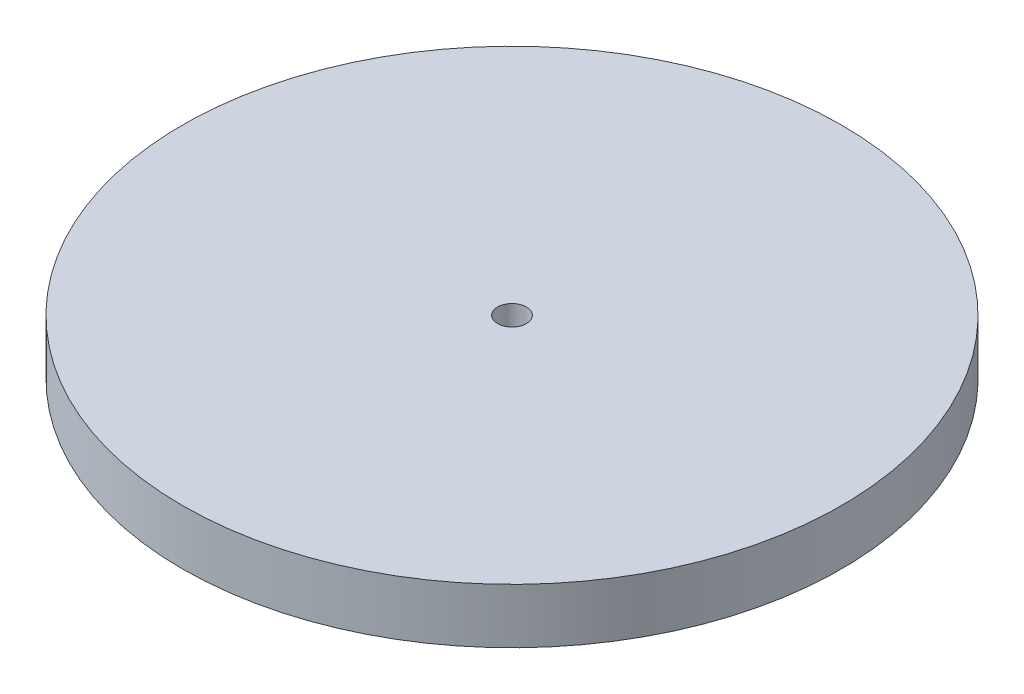
ISO-10303-21;
HEADER;
FILE_DESCRIPTION(('STEP AP214'),'2;1');
FILE_NAME('part.step','',(''),(''),'','','');
FILE_SCHEMA(('AUTOMOTIVE_DESIGN { 1 0 10303 214 1 1 1 1 }'));
ENDSEC;
DATA;
#1=APPLICATION_CONTEXT('core data for automotive mechanical design processes');
#2=APPLICATION_PROTOCOL_DEFINITION('international standard','automotive_design',2000,#1);
#3=PRODUCT_CONTEXT('',#1,'mechanical');
#4=PRODUCT('Part','Part','',(#3));
#5=PRODUCT_RELATED_PRODUCT_CATEGORY('part','',(#4));
#6=PRODUCT_DEFINITION_FORMATION('','',#4);
#7=PRODUCT_DEFINITION_CONTEXT('part definition',#1,'design');
#8=PRODUCT_DEFINITION('design','',#6,#7);
#9=PRODUCT_DEFINITION_SHAPE('','',#8);
#10=(LENGTH_UNIT() NAMED_UNIT(*) SI_UNIT(.MILLI.,.METRE.));
#11=(NAMED_UNIT(*) PLANE_ANGLE_UNIT() SI_UNIT($,.RADIAN.));
#12=(NAMED_UNIT(*) SI_UNIT($,.STERADIAN.) SOLID_ANGLE_UNIT());
#13=UNCERTAINTY_MEASURE_WITH_UNIT(LENGTH_MEASURE(1.E-05),#10,'distance_accuracy_value','');
#14=(GEOMETRIC_REPRESENTATION_CONTEXT(3) GLOBAL_UNCERTAINTY_ASSIGNED_CONTEXT((#13)) GLOBAL_UNIT_ASSIGNED_CONTEXT((#10,
#11,#12)) REPRESENTATION_CONTEXT('',''));
#15=CARTESIAN_POINT('',(0.,0.,0.));
#16=DIRECTION('',(0.,0.,1.));
#17=DIRECTION('',(1.,0.,0.));
#18=AXIS2_PLACEMENT_3D('',#15,#16,#17);
#19=CARTESIAN_POINT('',(0.,7.62,0.));
#20=DIRECTION('',(0.,1.,0.));
#21=DIRECTION('',(0.,0.,1.));
#22=AXIS2_PLACEMENT_3D('',#19,#20,#21);
#23=PLANE('',#22);
#24=CARTESIAN_POINT('',(0.,7.62,0.));
#25=DIRECTION('',(0.,1.,0.));
#26=DIRECTION('',(0.,0.,1.));
#27=AXIS2_PLACEMENT_3D('',#24,#25,#26);
#28=CIRCLE('',#27,45.72);
#29=CARTESIAN_POINT('',(0.,7.62,45.72));
#30=VERTEX_POINT('',#29);
#31=EDGE_CURVE('E10',#30,#30,#28,.T.);
#32=ORIENTED_EDGE('',*,*,#31,.T.);
#33=EDGE_LOOP('',(#32));
#34=FACE_BOUND('',#33,.T.);
#35=CARTESIAN_POINT('',(0.,7.62,0.));
#36=DIRECTION('',(0.,1.,0.));
#37=DIRECTION('',(0.,0.,1.));
#38=AXIS2_PLACEMENT_3D('',#35,#36,#37);
#39=CIRCLE('',#38,2.);
#40=CARTESIAN_POINT('',(0.,7.62,2.));
#41=VERTEX_POINT('',#40);
#42=EDGE_CURVE('E42',#41,#41,#39,.T.);
#43=ORIENTED_EDGE('',*,*,#42,.F.);
#44=EDGE_LOOP('',(#43));
#45=FACE_BOUND('',#44,.T.);
#46=ADVANCED_FACE('F31',(#34,#45),#23,.T.);
#47=CARTESIAN_POINT('',(0.,0.,0.));
#48=DIRECTION('',(0.,1.,0.));
#49=DIRECTION('',(0.,0.,1.));
#50=AXIS2_PLACEMENT_3D('',#47,#48,#49);
#51=PLANE('',#50);
#52=CARTESIAN_POINT('',(0.,0.,0.));
#53=DIRECTION('',(0.,1.,0.));
#54=DIRECTION('',(0.,0.,1.));
#55=AXIS2_PLACEMENT_3D('',#52,#53,#54);
#56=CIRCLE('',#55,45.72);
#57=CARTESIAN_POINT('',(0.,0.,45.72));
#58=VERTEX_POINT('',#57);
#59=EDGE_CURVE('E35',#58,#58,#56,.T.);
#60=ORIENTED_EDGE('',*,*,#59,.F.);
#61=EDGE_LOOP('',(#60));
#62=FACE_BOUND('',#61,.T.);
#63=CARTESIAN_POINT('',(0.,0.,0.));
#64=DIRECTION('',(0.,1.,0.));
#65=DIRECTION('',(0.,0.,1.));
#66=AXIS2_PLACEMENT_3D('',#63,#64,#65);
#67=CIRCLE('',#66,2.);
#68=CARTESIAN_POINT('',(0.,0.,2.));
#69=VERTEX_POINT('',#68);
#70=EDGE_CURVE('E44',#69,#69,#67,.T.);
#71=ORIENTED_EDGE('',*,*,#70,.T.);
#72=EDGE_LOOP('',(#71));
#73=FACE_BOUND('',#72,.T.);
#74=ADVANCED_FACE('F54',(#62,#73),#51,.F.);
#75=CARTESIAN_POINT('',(0.,7.62,0.));
#76=DIRECTION('',(0.,-1.,0.));
#77=DIRECTION('',(0.,0.,-1.));
#78=AXIS2_PLACEMENT_3D('',#75,#76,#77);
#79=CYLINDRICAL_SURFACE('',#78,45.72);
#80=ORIENTED_EDGE('',*,*,#31,.F.);
#81=EDGE_LOOP('',(#80));
#82=FACE_BOUND('',#81,.T.);
#83=ORIENTED_EDGE('',*,*,#59,.T.);
#84=EDGE_LOOP('',(#83));
#85=FACE_BOUND('',#84,.T.);
#86=ADVANCED_FACE('F33',(#82,#85),#79,.T.);
#87=CARTESIAN_POINT('',(0.,7.62,0.));
#88=DIRECTION('',(0.,-1.,0.));
#89=DIRECTION('',(0.,0.,-1.));
#90=AXIS2_PLACEMENT_3D('',#87,#88,#89);
#91=CYLINDRICAL_SURFACE('',#90,2.);
#92=ORIENTED_EDGE('',*,*,#42,.T.);
#93=EDGE_LOOP('',(#92));
#94=FACE_BOUND('',#93,.T.);
#95=ORIENTED_EDGE('',*,*,#70,.F.);
#96=EDGE_LOOP('',(#95));
#97=FACE_BOUND('',#96,.T.);
#98=ADVANCED_FACE('F50',(#94,#97),#91,.F.);
#99=CLOSED_SHELL('',(#46,#74,#86,#98));
#100=MANIFOLD_SOLID_BREP('B2',#99);
#101=ADVANCED_BREP_SHAPE_REPRESENTATION('',(#18,#100),#14);
#102=SHAPE_DEFINITION_REPRESENTATION(#9,#101);
ENDSEC;
END-ISO-10303-21;
